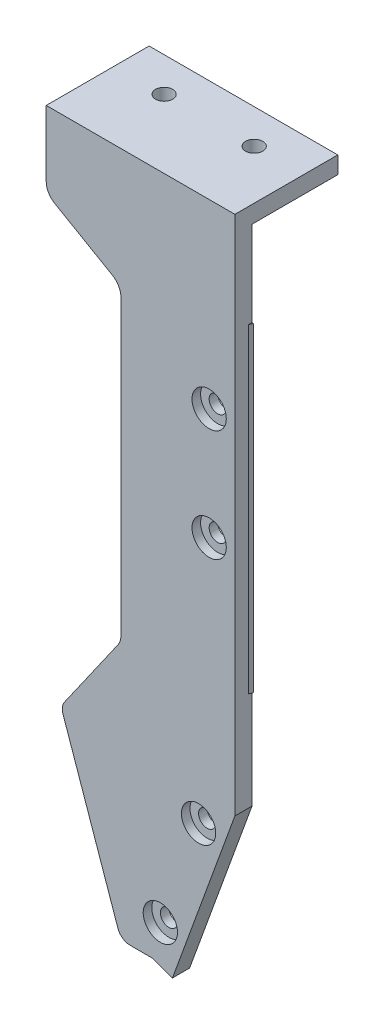
ISO-10303-21;
HEADER;
FILE_DESCRIPTION(('STEP AP214'),'2;1');
FILE_NAME('part.step','',(''),(''),'','','');
FILE_SCHEMA(('AUTOMOTIVE_DESIGN { 1 0 10303 214 1 1 1 1 }'));
ENDSEC;
DATA;
#1=APPLICATION_CONTEXT('core data for automotive mechanical design processes');
#2=APPLICATION_PROTOCOL_DEFINITION('international standard','automotive_design',2000,#1);
#3=PRODUCT_CONTEXT('',#1,'mechanical');
#4=PRODUCT('Part','Part','',(#3));
#5=PRODUCT_RELATED_PRODUCT_CATEGORY('part','',(#4));
#6=PRODUCT_DEFINITION_FORMATION('','',#4);
#7=PRODUCT_DEFINITION_CONTEXT('part definition',#1,'design');
#8=PRODUCT_DEFINITION('design','',#6,#7);
#9=PRODUCT_DEFINITION_SHAPE('','',#8);
#10=(LENGTH_UNIT() NAMED_UNIT(*) SI_UNIT(.MILLI.,.METRE.));
#11=(NAMED_UNIT(*) PLANE_ANGLE_UNIT() SI_UNIT($,.RADIAN.));
#12=(NAMED_UNIT(*) SI_UNIT($,.STERADIAN.) SOLID_ANGLE_UNIT());
#13=UNCERTAINTY_MEASURE_WITH_UNIT(LENGTH_MEASURE(1.E-05),#10,'distance_accuracy_value','');
#14=(GEOMETRIC_REPRESENTATION_CONTEXT(3) GLOBAL_UNCERTAINTY_ASSIGNED_CONTEXT((#13)) GLOBAL_UNIT_ASSIGNED_CONTEXT((#10,
#11,#12)) REPRESENTATION_CONTEXT('',''));
#15=CARTESIAN_POINT('',(0.,0.,0.));
#16=DIRECTION('',(0.,0.,1.));
#17=DIRECTION('',(1.,0.,0.));
#18=AXIS2_PLACEMENT_3D('',#15,#16,#17);
#19=CARTESIAN_POINT('',(91.0567161561715,-93.9915403547906,27.5));
#20=DIRECTION('',(0.,0.,-1.));
#21=DIRECTION('',(-1.,0.,0.));
#22=AXIS2_PLACEMENT_3D('',#19,#20,#21);
#23=CYLINDRICAL_SURFACE('',#22,0.999999999999998);
#24=CARTESIAN_POINT('',(91.0567161561715,-93.9915403547906,21.5));
#25=DIRECTION('',(0.,0.,-1.));
#26=DIRECTION('',(-1.,0.,0.));
#27=AXIS2_PLACEMENT_3D('',#24,#25,#26);
#28=CIRCLE('',#27,0.999999999999998);
#29=CARTESIAN_POINT('',(90.0567161561715,-93.9915403547906,21.5));
#30=VERTEX_POINT('',#29);
#31=EDGE_CURVE('E340',#30,#30,#28,.T.);
#32=ORIENTED_EDGE('',*,*,#31,.T.);
#33=EDGE_LOOP('',(#32));
#34=FACE_BOUND('',#33,.T.);
#35=CARTESIAN_POINT('',(91.0567161561715,-93.9915403547906,22.5));
#36=DIRECTION('',(0.,0.,1.));
#37=DIRECTION('',(1.,0.,0.));
#38=AXIS2_PLACEMENT_3D('',#35,#36,#37);
#39=CIRCLE('',#38,0.999999999999998);
#40=CARTESIAN_POINT('',(92.0567161561715,-93.9915403547906,22.5));
#41=VERTEX_POINT('',#40);
#42=EDGE_CURVE('E40',#41,#41,#39,.F.);
#43=ORIENTED_EDGE('',*,*,#42,.F.);
#44=EDGE_LOOP('',(#43));
#45=FACE_BOUND('',#44,.T.);
#46=ADVANCED_FACE('F36',(#34,#45),#23,.F.);
#47=CARTESIAN_POINT('',(86.6001936886376,-106.235735203631,27.5));
#48=DIRECTION('',(0.,0.,-1.));
#49=DIRECTION('',(-1.,0.,0.));
#50=AXIS2_PLACEMENT_3D('',#47,#48,#49);
#51=CYLINDRICAL_SURFACE('',#50,0.999999999999998);
#52=CARTESIAN_POINT('',(86.6001936886376,-106.235735203631,21.5));
#53=DIRECTION('',(0.,0.,-1.));
#54=DIRECTION('',(-1.,0.,0.));
#55=AXIS2_PLACEMENT_3D('',#52,#53,#54);
#56=CIRCLE('',#55,0.999999999999998);
#57=CARTESIAN_POINT('',(85.6001936886376,-106.235735203631,21.5));
#58=VERTEX_POINT('',#57);
#59=EDGE_CURVE('E365',#58,#58,#56,.T.);
#60=ORIENTED_EDGE('',*,*,#59,.T.);
#61=EDGE_LOOP('',(#60));
#62=FACE_BOUND('',#61,.T.);
#63=CARTESIAN_POINT('',(86.6001936886376,-106.235735203631,22.5));
#64=DIRECTION('',(0.,0.,1.));
#65=DIRECTION('',(1.,0.,0.));
#66=AXIS2_PLACEMENT_3D('',#63,#64,#65);
#67=CIRCLE('',#66,0.999999999999998);
#68=CARTESIAN_POINT('',(87.6001936886376,-106.235735203631,22.5));
#69=VERTEX_POINT('',#68);
#70=EDGE_CURVE('E344',#69,#69,#67,.F.);
#71=ORIENTED_EDGE('',*,*,#70,.F.);
#72=EDGE_LOOP('',(#71));
#73=FACE_BOUND('',#72,.T.);
#74=ADVANCED_FACE('F427',(#62,#73),#51,.F.);
#75=CARTESIAN_POINT('',(92.2895532458189,-64.5135083268963,27.5));
#76=DIRECTION('',(0.,0.,-1.));
#77=DIRECTION('',(-1.,0.,0.));
#78=AXIS2_PLACEMENT_3D('',#75,#76,#77);
#79=CYLINDRICAL_SURFACE('',#78,0.999999999999998);
#80=CARTESIAN_POINT('',(92.2895532458189,-64.5135083268963,21.5));
#81=DIRECTION('',(0.,0.,-1.));
#82=DIRECTION('',(-1.,0.,0.));
#83=AXIS2_PLACEMENT_3D('',#80,#81,#82);
#84=CIRCLE('',#83,0.999999999999998);
#85=CARTESIAN_POINT('',(91.2895532458189,-64.5135083268963,21.5));
#86=VERTEX_POINT('',#85);
#87=EDGE_CURVE('E361',#86,#86,#84,.T.);
#88=ORIENTED_EDGE('',*,*,#87,.T.);
#89=EDGE_LOOP('',(#88));
#90=FACE_BOUND('',#89,.T.);
#91=CARTESIAN_POINT('',(92.2895532458189,-64.5135083268963,22.5));
#92=DIRECTION('',(0.,0.,1.));
#93=DIRECTION('',(1.,0.,0.));
#94=AXIS2_PLACEMENT_3D('',#91,#92,#93);
#95=CIRCLE('',#94,0.999999999999998);
#96=CARTESIAN_POINT('',(93.2895532458189,-64.5135083268963,22.5));
#97=VERTEX_POINT('',#96);
#98=EDGE_CURVE('E342',#97,#97,#95,.F.);
#99=ORIENTED_EDGE('',*,*,#98,.F.);
#100=EDGE_LOOP('',(#99));
#101=FACE_BOUND('',#100,.T.);
#102=ADVANCED_FACE('F434',(#90,#101),#79,.F.);
#103=CARTESIAN_POINT('',(92.2895532458189,-51.5135083268963,27.5));
#104=DIRECTION('',(0.,0.,-1.));
#105=DIRECTION('',(-1.,0.,0.));
#106=AXIS2_PLACEMENT_3D('',#103,#104,#105);
#107=CYLINDRICAL_SURFACE('',#106,0.999999999999998);
#108=CARTESIAN_POINT('',(92.2895532458189,-51.5135083268963,21.5));
#109=DIRECTION('',(0.,0.,-1.));
#110=DIRECTION('',(-1.,0.,0.));
#111=AXIS2_PLACEMENT_3D('',#108,#109,#110);
#112=CIRCLE('',#111,0.999999999999998);
#113=CARTESIAN_POINT('',(91.2895532458189,-51.5135083268963,21.5));
#114=VERTEX_POINT('',#113);
#115=EDGE_CURVE('E364',#114,#114,#112,.T.);
#116=ORIENTED_EDGE('',*,*,#115,.T.);
#117=EDGE_LOOP('',(#116));
#118=FACE_BOUND('',#117,.T.);
#119=CARTESIAN_POINT('',(92.2895532458189,-51.5135083268963,22.5));
#120=DIRECTION('',(0.,0.,1.));
#121=DIRECTION('',(1.,0.,0.));
#122=AXIS2_PLACEMENT_3D('',#119,#120,#121);
#123=CIRCLE('',#122,0.999999999999998);
#124=CARTESIAN_POINT('',(93.2895532458189,-51.5135083268963,22.5));
#125=VERTEX_POINT('',#124);
#126=EDGE_CURVE('E337',#125,#125,#123,.F.);
#127=ORIENTED_EDGE('',*,*,#126,.F.);
#128=EDGE_LOOP('',(#127));
#129=FACE_BOUND('',#128,.T.);
#130=ADVANCED_FACE('F440',(#118,#129),#107,.F.);
#131=CARTESIAN_POINT('',(70.,-110.3,21.5));
#132=DIRECTION('',(0.,0.,1.));
#133=DIRECTION('',(0.,-1.,0.));
#134=AXIS2_PLACEMENT_3D('',#131,#132,#133);
#135=PLANE('',#134);
#136=ORIENTED_EDGE('',*,*,#87,.F.);
#137=EDGE_LOOP('',(#136));
#138=FACE_BOUND('',#137,.T.);
#139=ORIENTED_EDGE('',*,*,#59,.F.);
#140=EDGE_LOOP('',(#139));
#141=FACE_BOUND('',#140,.T.);
#142=ORIENTED_EDGE('',*,*,#31,.F.);
#143=EDGE_LOOP('',(#142));
#144=FACE_BOUND('',#143,.T.);
#145=ORIENTED_EDGE('',*,*,#115,.F.);
#146=EDGE_LOOP('',(#145));
#147=FACE_BOUND('',#146,.T.);
#148=DIRECTION('',(-1.,0.,0.));
#149=VECTOR('',#148,1.);
#150=CARTESIAN_POINT('',(73.2895532458189,-32.3635083268963,21.5));
#151=LINE('',#150,#149);
#152=CARTESIAN_POINT('',(95.2895532458189,-32.3635083268963,21.5));
#153=VERTEX_POINT('',#152);
#154=CARTESIAN_POINT('',(73.2895532458189,-32.3635083268963,21.5));
#155=VERTEX_POINT('',#154);
#156=EDGE_CURVE('E53',#153,#155,#151,.T.);
#157=ORIENTED_EDGE('',*,*,#156,.F.);
#158=DIRECTION('',(0.,1.,0.));
#159=VECTOR('',#158,1.);
#160=CARTESIAN_POINT('',(95.2895532458189,0.,21.5));
#161=LINE('',#160,#159);
#162=CARTESIAN_POINT('',(95.2895532458189,-42.3,21.5));
#163=VERTEX_POINT('',#162);
#164=EDGE_CURVE('E196',#163,#153,#161,.T.);
#165=ORIENTED_EDGE('',*,*,#164,.F.);
#166=DIRECTION('',(1.,0.,0.));
#167=VECTOR('',#166,1.);
#168=CARTESIAN_POINT('',(94.75,-42.3,21.5));
#169=LINE('',#168,#167);
#170=CARTESIAN_POINT('',(95.4364916731037,-42.3,21.5));
#171=VERTEX_POINT('',#170);
#172=EDGE_CURVE('E263',#163,#171,#169,.T.);
#173=ORIENTED_EDGE('',*,*,#172,.T.);
#174=DIRECTION('',(0.,-1.,0.));
#175=VECTOR('',#174,1.);
#176=CARTESIAN_POINT('',(95.4364916731037,-42.3,21.5));
#177=LINE('',#176,#175);
#178=CARTESIAN_POINT('',(95.4364916731037,-79.5997924618132,21.5));
#179=VERTEX_POINT('',#178);
#180=EDGE_CURVE('E265',#171,#179,#177,.T.);
#181=ORIENTED_EDGE('',*,*,#180,.T.);
#182=DIRECTION('',(1.,0.,0.));
#183=VECTOR('',#182,1.);
#184=CARTESIAN_POINT('',(94.38388347648,-79.59979246179,21.5));
#185=LINE('',#184,#183);
#186=CARTESIAN_POINT('',(95.2895532458189,-79.5997924618016,21.5));
#187=VERTEX_POINT('',#186);
#188=EDGE_CURVE('E268',#187,#179,#185,.T.);
#189=ORIENTED_EDGE('',*,*,#188,.F.);
#190=CARTESIAN_POINT('',(95.2895532458189,-91.1333292312439,21.5));
#191=VERTEX_POINT('',#190);
#192=EDGE_CURVE('E209',#191,#187,#161,.T.);
#193=ORIENTED_EDGE('',*,*,#192,.F.);
#194=DIRECTION('',(-0.342020143325699,-0.939692620785897,0.));
#195=VECTOR('',#194,1.);
#196=CARTESIAN_POINT('',(95.2895532458189,-91.1333292312439,21.5));
#197=LINE('',#196,#195);
#198=CARTESIAN_POINT('',(88.0101485604946,-111.133329231243,21.5));
#199=VERTEX_POINT('',#198);
#200=EDGE_CURVE('E260',#191,#199,#197,.T.);
#201=ORIENTED_EDGE('',*,*,#200,.T.);
#202=DIRECTION('',(-0.939692620785897,0.342020143325699,0.));
#203=VECTOR('',#202,1.);
#204=CARTESIAN_POINT('',(86.190441625069,-110.47101007166,21.5));
#205=LINE('',#204,#203);
#206=CARTESIAN_POINT('',(85.720595314676,-110.3,21.5));
#207=VERTEX_POINT('',#206);
#208=EDGE_CURVE('E271',#199,#207,#205,.T.);
#209=ORIENTED_EDGE('',*,*,#208,.T.);
#210=DIRECTION('',(1.,0.,0.));
#211=VECTOR('',#210,1.);
#212=CARTESIAN_POINT('',(83.066681965713,-110.3,21.5));
#213=LINE('',#212,#211);
#214=CARTESIAN_POINT('',(83.066681965713,-110.3,21.5));
#215=VERTEX_POINT('',#214);
#216=EDGE_CURVE('E276',#215,#207,#213,.T.);
#217=ORIENTED_EDGE('',*,*,#216,.F.);
#218=CARTESIAN_POINT('',(83.066681965713,-108.8,21.5));
#219=DIRECTION('',(0.,0.,-1.));
#220=DIRECTION('',(0.,-1.,0.));
#221=AXIS2_PLACEMENT_3D('',#218,#219,#220);
#222=CIRCLE('',#221,1.5);
#223=CARTESIAN_POINT('',(81.6498173079181,-109.29243734778,21.5));
#224=VERTEX_POINT('',#223);
#225=EDGE_CURVE('E275',#215,#224,#222,.T.);
#226=ORIENTED_EDGE('',*,*,#225,.T.);
#227=DIRECTION('',(-0.328291565188003,0.944576438530208,0.));
#228=VECTOR('',#227,1.);
#229=CARTESIAN_POINT('',(81.6498173079181,-109.29243734778,21.5));
#230=LINE('',#229,#228);
#231=CARTESIAN_POINT('',(75.251803773117,-90.88376201398,21.5));
#232=VERTEX_POINT('',#231);
#233=EDGE_CURVE('E281',#224,#232,#230,.T.);
#234=ORIENTED_EDGE('',*,*,#233,.T.);
#235=CARTESIAN_POINT('',(76.668668430912,-90.3913246662,21.5));
#236=DIRECTION('',(0.,0.,-1.));
#237=DIRECTION('',(-0.944576438530206,-0.328291565188007,0.));
#238=AXIS2_PLACEMENT_3D('',#235,#236,#237);
#239=CIRCLE('',#238,1.5);
#240=CARTESIAN_POINT('',(75.439940364479,-89.5309600116699,21.5));
#241=VERTEX_POINT('',#240);
#242=EDGE_CURVE('E284',#232,#241,#239,.T.);
#243=ORIENTED_EDGE('',*,*,#242,.T.);
#244=DIRECTION('',(0.573576436351011,0.819152044289016,0.));
#245=VECTOR('',#244,1.);
#246=CARTESIAN_POINT('',(75.439940364479,-89.5309600116699,21.5));
#247=LINE('',#246,#245);
#248=CARTESIAN_POINT('',(81.638304088578,-80.67877921404,21.5));
#249=VERTEX_POINT('',#248);
#250=EDGE_CURVE('E287',#241,#249,#247,.T.);
#251=ORIENTED_EDGE('',*,*,#250,.T.);
#252=CARTESIAN_POINT('',(80.,-79.5316263413399,21.5));
#253=DIRECTION('',(0.,0.,1.));
#254=DIRECTION('',(0.81915204428897,-0.573576436351077,0.));
#255=AXIS2_PLACEMENT_3D('',#252,#253,#254);
#256=CIRCLE('',#255,2.);
#257=CARTESIAN_POINT('',(82.,-79.5316263413399,21.5));
#258=VERTEX_POINT('',#257);
#259=EDGE_CURVE('E290',#249,#258,#256,.T.);
#260=ORIENTED_EDGE('',*,*,#259,.T.);
#261=DIRECTION('',(0.,1.,0.));
#262=VECTOR('',#261,1.);
#263=CARTESIAN_POINT('',(82.,-79.5316263413399,21.5));
#264=LINE('',#263,#262);
#265=CARTESIAN_POINT('',(82.,-45.38290376865,21.5));
#266=VERTEX_POINT('',#265);
#267=EDGE_CURVE('E293',#258,#266,#264,.T.);
#268=ORIENTED_EDGE('',*,*,#267,.T.);
#269=CARTESIAN_POINT('',(80.,-45.38290376865,21.5));
#270=DIRECTION('',(0.,0.,1.));
#271=DIRECTION('',(1.,0.,0.));
#272=AXIS2_PLACEMENT_3D('',#269,#270,#271);
#273=CIRCLE('',#272,2.);
#274=CARTESIAN_POINT('',(81.,-43.65085296109,21.5));
#275=VERTEX_POINT('',#274);
#276=EDGE_CURVE('E296',#266,#275,#273,.T.);
#277=ORIENTED_EDGE('',*,*,#276,.T.);
#278=DIRECTION('',(-0.866025403784429,0.500000000000017,0.));
#279=VECTOR('',#278,1.);
#280=CARTESIAN_POINT('',(81.,-43.65085296109,21.5));
#281=LINE('',#280,#279);
#282=CARTESIAN_POINT('',(74.2895532458181,-39.7765747211803,21.5));
#283=VERTEX_POINT('',#282);
#284=EDGE_CURVE('E299',#275,#283,#281,.T.);
#285=ORIENTED_EDGE('',*,*,#284,.T.);
#286=CARTESIAN_POINT('',(75.2895532458189,-38.0445239136101,21.5));
#287=DIRECTION('',(0.,0.,1.));
#288=DIRECTION('',(1.,0.,0.));
#289=AXIS2_PLACEMENT_3D('',#286,#287,#288);
#290=CIRCLE('',#289,2.);
#291=CARTESIAN_POINT('',(73.2895532458189,-38.0445239136101,21.5));
#292=VERTEX_POINT('',#291);
#293=EDGE_CURVE('E333',#283,#292,#290,.F.);
#294=ORIENTED_EDGE('',*,*,#293,.T.);
#295=DIRECTION('',(0.,-1.,0.));
#296=VECTOR('',#295,1.);
#297=CARTESIAN_POINT('',(73.2895532458189,0.,21.5));
#298=LINE('',#297,#296);
#299=EDGE_CURVE('E197',#155,#292,#298,.T.);
#300=ORIENTED_EDGE('',*,*,#299,.F.);
#301=EDGE_LOOP('',(#157,#165,#173,#181,#189,#193,#201,#209,#217,#226,#234,#243,#251,#260,#268,
#277,#285,#294,#300));
#302=FACE_BOUND('',#301,.T.);
#303=ADVANCED_FACE('F401',(#138,#141,#144,#147,#302),#135,.F.);
#304=CARTESIAN_POINT('',(93.5,-42.3,21.));
#305=DIRECTION('',(0.,-1.,0.));
#306=DIRECTION('',(-1.,0.,0.));
#307=AXIS2_PLACEMENT_3D('',#304,#305,#306);
#308=CYLINDRICAL_SURFACE('',#307,2.);
#309=CARTESIAN_POINT('',(93.5,-42.3,21.));
#310=DIRECTION('',(0.,-1.,0.));
#311=DIRECTION('',(1.,0.,0.));
#312=AXIS2_PLACEMENT_3D('',#309,#310,#311);
#313=CIRCLE('',#312,2.);
#314=CARTESIAN_POINT('',(95.2895532458189,-42.3,21.8930280960748));
#315=VERTEX_POINT('',#314);
#316=EDGE_CURVE('E323',#171,#315,#313,.T.);
#317=ORIENTED_EDGE('',*,*,#316,.T.);
#318=DIRECTION('',(0.,-1.,0.));
#319=VECTOR('',#318,1.);
#320=CARTESIAN_POINT('',(95.2895532458189,-42.3,21.8930280960748));
#321=LINE('',#320,#319);
#322=CARTESIAN_POINT('',(95.2895532458189,-79.5997924618132,21.8930280960748));
#323=VERTEX_POINT('',#322);
#324=EDGE_CURVE('E255',#315,#323,#321,.T.);
#325=ORIENTED_EDGE('',*,*,#324,.T.);
#326=CARTESIAN_POINT('',(93.5,-79.59979246179,21.));
#327=DIRECTION('',(0.,-1.,0.));
#328=DIRECTION('',(1.,0.,0.));
#329=AXIS2_PLACEMENT_3D('',#326,#327,#328);
#330=CIRCLE('',#329,2.);
#331=EDGE_CURVE('E274',#179,#323,#330,.T.);
#332=ORIENTED_EDGE('',*,*,#331,.F.);
#333=ORIENTED_EDGE('',*,*,#180,.F.);
#334=EDGE_LOOP('',(#317,#325,#332,#333));
#335=FACE_BOUND('',#334,.T.);
#336=ADVANCED_FACE('F408',(#335),#308,.T.);
#337=CARTESIAN_POINT('',(94.38388347648,-79.59979246179,21.88388347648));
#338=DIRECTION('',(0.,1.,0.));
#339=DIRECTION('',(0.,0.,-1.));
#340=AXIS2_PLACEMENT_3D('',#337,#338,#339);
#341=PLANE('',#340);
#342=DIRECTION('',(0.,0.,1.));
#343=VECTOR('',#342,1.);
#344=CARTESIAN_POINT('',(95.2895532458189,-79.59979246179,21.88388347648));
#345=LINE('',#344,#343);
#346=EDGE_CURVE('E258',#187,#323,#345,.T.);
#347=ORIENTED_EDGE('',*,*,#346,.F.);
#348=ORIENTED_EDGE('',*,*,#188,.T.);
#349=ORIENTED_EDGE('',*,*,#331,.T.);
#350=EDGE_LOOP('',(#347,#348,#349));
#351=FACE_BOUND('',#350,.T.);
#352=ADVANCED_FACE('F404',(#351),#341,.F.);
#353=CARTESIAN_POINT('',(94.75,-42.3,18.));
#354=DIRECTION('',(0.,1.,0.));
#355=DIRECTION('',(0.,0.,-1.));
#356=AXIS2_PLACEMENT_3D('',#353,#354,#355);
#357=PLANE('',#356);
#358=ORIENTED_EDGE('',*,*,#172,.F.);
#359=DIRECTION('',(0.,0.,1.));
#360=VECTOR('',#359,1.);
#361=CARTESIAN_POINT('',(95.2895532458189,-42.3,18.));
#362=LINE('',#361,#360);
#363=EDGE_CURVE('E248',#163,#315,#362,.T.);
#364=ORIENTED_EDGE('',*,*,#363,.T.);
#365=ORIENTED_EDGE('',*,*,#316,.F.);
#366=EDGE_LOOP('',(#358,#364,#365));
#367=FACE_BOUND('',#366,.T.);
#368=ADVANCED_FACE('F412',(#367),#357,.T.);
#369=CARTESIAN_POINT('',(76.,-40.76410161514,22.25));
#370=DIRECTION('',(0.500000000000017,0.866025403784429,0.));
#371=DIRECTION('',(0.866025403784429,-0.500000000000017,0.));
#372=AXIS2_PLACEMENT_3D('',#369,#370,#371);
#373=PLANE('',#372);
#374=DIRECTION('',(-0.866025403784429,0.500000000000017,0.));
#375=VECTOR('',#374,1.);
#376=CARTESIAN_POINT('',(1.34862621941938,2.3358891324538,23.5));
#377=LINE('',#376,#375);
#378=CARTESIAN_POINT('',(81.,-43.65085296109,23.5));
#379=VERTEX_POINT('',#378);
#380=CARTESIAN_POINT('',(74.2895532458182,-39.7765747211803,23.5));
#381=VERTEX_POINT('',#380);
#382=EDGE_CURVE('E239',#379,#381,#377,.T.);
#383=ORIENTED_EDGE('',*,*,#382,.T.);
#384=DIRECTION('',(0.,0.,-1.));
#385=VECTOR('',#384,1.);
#386=CARTESIAN_POINT('',(74.2895532458189,-39.776574721179,22.25));
#387=LINE('',#386,#385);
#388=EDGE_CURVE('E330',#381,#283,#387,.T.);
#389=ORIENTED_EDGE('',*,*,#388,.T.);
#390=ORIENTED_EDGE('',*,*,#284,.F.);
#391=DIRECTION('',(0.,0.,-1.));
#392=VECTOR('',#391,1.);
#393=CARTESIAN_POINT('',(81.,-43.65085296109,23.));
#394=LINE('',#393,#392);
#395=EDGE_CURVE('E302',#379,#275,#394,.T.);
#396=ORIENTED_EDGE('',*,*,#395,.F.);
#397=EDGE_LOOP('',(#383,#389,#390,#396));
#398=FACE_BOUND('',#397,.T.);
#399=ADVANCED_FACE('F414',(#398),#373,.F.);
#400=CARTESIAN_POINT('',(80.,-45.38290376865,69.9296));
#401=DIRECTION('',(0.,0.,-1.));
#402=DIRECTION('',(-0.500000000000015,-0.86602540378443,0.));
#403=AXIS2_PLACEMENT_3D('',#400,#401,#402);
#404=CYLINDRICAL_SURFACE('',#403,2.);
#405=ORIENTED_EDGE('',*,*,#276,.F.);
#406=DIRECTION('',(0.,0.,-1.));
#407=VECTOR('',#406,1.);
#408=CARTESIAN_POINT('',(82.,-45.38290376865,23.));
#409=LINE('',#408,#407);
#410=CARTESIAN_POINT('',(82.,-45.38290376865,23.5));
#411=VERTEX_POINT('',#410);
#412=EDGE_CURVE('E305',#411,#266,#409,.T.);
#413=ORIENTED_EDGE('',*,*,#412,.F.);
#414=CARTESIAN_POINT('',(80.,-45.38290376865,23.5));
#415=DIRECTION('',(0.,0.,-1.));
#416=DIRECTION('',(-1.,0.,0.));
#417=AXIS2_PLACEMENT_3D('',#414,#415,#416);
#418=CIRCLE('',#417,2.);
#419=EDGE_CURVE('E236',#411,#379,#418,.F.);
#420=ORIENTED_EDGE('',*,*,#419,.T.);
#421=ORIENTED_EDGE('',*,*,#395,.T.);
#422=EDGE_LOOP('',(#405,#413,#420,#421));
#423=FACE_BOUND('',#422,.T.);
#424=ADVANCED_FACE('F421',(#423),#404,.F.);
#425=CARTESIAN_POINT('',(82.,-62.19521357469,22.25));
#426=DIRECTION('',(1.,0.,0.));
#427=DIRECTION('',(0.,-1.,0.));
#428=AXIS2_PLACEMENT_3D('',#425,#426,#427);
#429=PLANE('',#428);
#430=DIRECTION('',(0.,0.,-1.));
#431=VECTOR('',#430,1.);
#432=CARTESIAN_POINT('',(82.,-79.5316263413399,23.));
#433=LINE('',#432,#431);
#434=CARTESIAN_POINT('',(82.,-79.5316263413399,23.5));
#435=VERTEX_POINT('',#434);
#436=EDGE_CURVE('E308',#435,#258,#433,.T.);
#437=ORIENTED_EDGE('',*,*,#436,.F.);
#438=DIRECTION('',(0.,1.,0.));
#439=VECTOR('',#438,1.);
#440=CARTESIAN_POINT('',(82.,0.,23.5));
#441=LINE('',#440,#439);
#442=EDGE_CURVE('E233',#435,#411,#441,.T.);
#443=ORIENTED_EDGE('',*,*,#442,.T.);
#444=ORIENTED_EDGE('',*,*,#412,.T.);
#445=ORIENTED_EDGE('',*,*,#267,.F.);
#446=EDGE_LOOP('',(#437,#443,#444,#445));
#447=FACE_BOUND('',#446,.T.);
#448=ADVANCED_FACE('F777',(#447),#429,.F.);
#449=CARTESIAN_POINT('',(80.,-79.5316263413399,69.9296));
#450=DIRECTION('',(0.,0.,-1.));
#451=DIRECTION('',(-1.,0.,0.));
#452=AXIS2_PLACEMENT_3D('',#449,#450,#451);
#453=CYLINDRICAL_SURFACE('',#452,2.);
#454=ORIENTED_EDGE('',*,*,#259,.F.);
#455=DIRECTION('',(0.,0.,-1.));
#456=VECTOR('',#455,1.);
#457=CARTESIAN_POINT('',(81.638304088578,-80.67877921404,23.));
#458=LINE('',#457,#456);
#459=CARTESIAN_POINT('',(81.6383040885789,-80.6787792140407,23.5));
#460=VERTEX_POINT('',#459);
#461=EDGE_CURVE('E312',#460,#249,#458,.T.);
#462=ORIENTED_EDGE('',*,*,#461,.F.);
#463=CARTESIAN_POINT('',(80.,-79.5316263413399,23.5));
#464=DIRECTION('',(0.,0.,-1.));
#465=DIRECTION('',(-1.,0.,0.));
#466=AXIS2_PLACEMENT_3D('',#463,#464,#465);
#467=CIRCLE('',#466,2.);
#468=EDGE_CURVE('E230',#460,#435,#467,.F.);
#469=ORIENTED_EDGE('',*,*,#468,.T.);
#470=ORIENTED_EDGE('',*,*,#436,.T.);
#471=EDGE_LOOP('',(#454,#462,#469,#470));
#472=FACE_BOUND('',#471,.T.);
#473=ADVANCED_FACE('F766',(#472),#453,.F.);
#474=CARTESIAN_POINT('',(76.,-88.7311119595499,22.25));
#475=DIRECTION('',(0.819152044289016,-0.573576436351011,0.));
#476=DIRECTION('',(-0.573576436351011,-0.819152044289016,0.));
#477=AXIS2_PLACEMENT_3D('',#474,#475,#476);
#478=PLANE('',#477);
#479=ORIENTED_EDGE('',*,*,#250,.F.);
#480=DIRECTION('',(0.,0.,1.));
#481=VECTOR('',#480,1.);
#482=CARTESIAN_POINT('',(75.439940364479,-89.5309600116699,21.5));
#483=LINE('',#482,#481);
#484=CARTESIAN_POINT('',(75.439940364479,-89.5309600116699,23.5));
#485=VERTEX_POINT('',#484);
#486=EDGE_CURVE('E311',#241,#485,#483,.T.);
#487=ORIENTED_EDGE('',*,*,#486,.T.);
#488=DIRECTION('',(0.573576436351011,0.819152044289016,0.));
#489=VECTOR('',#488,1.);
#490=CARTESIAN_POINT('',(92.6867510176329,-64.8999617547072,23.5));
#491=LINE('',#490,#489);
#492=EDGE_CURVE('E227',#485,#460,#491,.T.);
#493=ORIENTED_EDGE('',*,*,#492,.T.);
#494=ORIENTED_EDGE('',*,*,#461,.T.);
#495=EDGE_LOOP('',(#479,#487,#493,#494));
#496=FACE_BOUND('',#495,.T.);
#497=ADVANCED_FACE('F755',(#496),#478,.F.);
#498=CARTESIAN_POINT('',(76.668668430912,-90.3913246662,-59.9296));
#499=DIRECTION('',(0.,0.,1.));
#500=DIRECTION('',(0.819152044289016,-0.573576436351012,0.));
#501=AXIS2_PLACEMENT_3D('',#498,#499,#500);
#502=CYLINDRICAL_SURFACE('',#501,1.5);
#503=ORIENTED_EDGE('',*,*,#486,.F.);
#504=ORIENTED_EDGE('',*,*,#242,.F.);
#505=DIRECTION('',(0.,0.,1.));
#506=VECTOR('',#505,1.);
#507=CARTESIAN_POINT('',(75.251803773117,-90.88376201398,21.5));
#508=LINE('',#507,#506);
#509=CARTESIAN_POINT('',(75.2518037731161,-90.8837620139803,23.5));
#510=VERTEX_POINT('',#509);
#511=EDGE_CURVE('E315',#232,#510,#508,.T.);
#512=ORIENTED_EDGE('',*,*,#511,.T.);
#513=CARTESIAN_POINT('',(76.668668430912,-90.3913246662,23.5));
#514=DIRECTION('',(0.,0.,-1.));
#515=DIRECTION('',(-1.,0.,0.));
#516=AXIS2_PLACEMENT_3D('',#513,#514,#515);
#517=CIRCLE('',#516,1.5);
#518=EDGE_CURVE('E224',#510,#485,#517,.T.);
#519=ORIENTED_EDGE('',*,*,#518,.T.);
#520=EDGE_LOOP('',(#503,#504,#512,#519));
#521=FACE_BOUND('',#520,.T.);
#522=ADVANCED_FACE('F744',(#521),#502,.T.);
#523=CARTESIAN_POINT('',(78.5,-100.22962998314,22.25));
#524=DIRECTION('',(0.944576438530208,0.328291565188003,0.));
#525=DIRECTION('',(0.328291565188003,-0.944576438530208,0.));
#526=AXIS2_PLACEMENT_3D('',#523,#524,#525);
#527=PLANE('',#526);
#528=ORIENTED_EDGE('',*,*,#233,.F.);
#529=DIRECTION('',(0.,0.,1.));
#530=VECTOR('',#529,1.);
#531=CARTESIAN_POINT('',(81.6498173079181,-109.29243734778,21.5));
#532=LINE('',#531,#530);
#533=CARTESIAN_POINT('',(81.6498173079181,-109.29243734778,23.5));
#534=VERTEX_POINT('',#533);
#535=EDGE_CURVE('E318',#224,#534,#532,.T.);
#536=ORIENTED_EDGE('',*,*,#535,.T.);
#537=DIRECTION('',(-0.328291565188003,0.944576438530208,0.));
#538=VECTOR('',#537,1.);
#539=CARTESIAN_POINT('',(38.9587796924058,13.5402898498463,23.5));
#540=LINE('',#539,#538);
#541=EDGE_CURVE('E221',#534,#510,#540,.T.);
#542=ORIENTED_EDGE('',*,*,#541,.T.);
#543=ORIENTED_EDGE('',*,*,#511,.F.);
#544=EDGE_LOOP('',(#528,#536,#542,#543));
#545=FACE_BOUND('',#544,.T.);
#546=ADVANCED_FACE('F733',(#545),#527,.F.);
#547=CARTESIAN_POINT('',(83.066681965713,-108.8,-59.9296));
#548=DIRECTION('',(0.,0.,1.));
#549=DIRECTION('',(0.944576438530206,0.328291565188007,0.));
#550=AXIS2_PLACEMENT_3D('',#547,#548,#549);
#551=CYLINDRICAL_SURFACE('',#550,1.5);
#552=ORIENTED_EDGE('',*,*,#535,.F.);
#553=ORIENTED_EDGE('',*,*,#225,.F.);
#554=DIRECTION('',(0.,0.,1.));
#555=VECTOR('',#554,1.);
#556=CARTESIAN_POINT('',(83.066681965713,-110.3,21.5));
#557=LINE('',#556,#555);
#558=CARTESIAN_POINT('',(83.066681965713,-110.3,23.5));
#559=VERTEX_POINT('',#558);
#560=EDGE_CURVE('E278',#215,#559,#557,.T.);
#561=ORIENTED_EDGE('',*,*,#560,.T.);
#562=CARTESIAN_POINT('',(83.066681965713,-108.8,23.5));
#563=DIRECTION('',(0.,0.,-1.));
#564=DIRECTION('',(-1.,0.,0.));
#565=AXIS2_PLACEMENT_3D('',#562,#563,#564);
#566=CIRCLE('',#565,1.5);
#567=EDGE_CURVE('E218',#559,#534,#566,.T.);
#568=ORIENTED_EDGE('',*,*,#567,.T.);
#569=EDGE_LOOP('',(#552,#553,#561,#568));
#570=FACE_BOUND('',#569,.T.);
#571=ADVANCED_FACE('F722',(#570),#551,.T.);
#572=CARTESIAN_POINT('',(81.5,-110.3,22.25));
#573=DIRECTION('',(0.,-1.,0.));
#574=DIRECTION('',(-1.,0.,0.));
#575=AXIS2_PLACEMENT_3D('',#572,#573,#574);
#576=PLANE('',#575);
#577=ORIENTED_EDGE('',*,*,#216,.T.);
#578=DIRECTION('',(0.,0.,-1.));
#579=VECTOR('',#578,1.);
#580=CARTESIAN_POINT('',(85.720595314676,-110.3,23.));
#581=LINE('',#580,#579);
#582=CARTESIAN_POINT('',(85.720595314676,-110.3,23.5));
#583=VERTEX_POINT('',#582);
#584=EDGE_CURVE('E270',#583,#207,#581,.T.);
#585=ORIENTED_EDGE('',*,*,#584,.F.);
#586=DIRECTION('',(-1.,0.,0.));
#587=VECTOR('',#586,1.);
#588=CARTESIAN_POINT('',(-1.77186336060973E-12,-110.299999999999,23.5));
#589=LINE('',#588,#587);
#590=EDGE_CURVE('E215',#583,#559,#589,.T.);
#591=ORIENTED_EDGE('',*,*,#590,.T.);
#592=ORIENTED_EDGE('',*,*,#560,.F.);
#593=EDGE_LOOP('',(#577,#585,#591,#592));
#594=FACE_BOUND('',#593,.T.);
#595=ADVANCED_FACE('F712',(#594),#576,.T.);
#596=CARTESIAN_POINT('',(86.190441625069,-110.47101007166,22.25));
#597=DIRECTION('',(-0.342020143325699,-0.939692620785897,0.));
#598=DIRECTION('',(-0.939692620785897,0.342020143325699,0.));
#599=AXIS2_PLACEMENT_3D('',#596,#597,#598);
#600=PLANE('',#599);
#601=ORIENTED_EDGE('',*,*,#208,.F.);
#602=DIRECTION('',(0.,0.,-1.));
#603=VECTOR('',#602,1.);
#604=CARTESIAN_POINT('',(88.0101485604946,-111.133329231243,23.5));
#605=LINE('',#604,#603);
#606=CARTESIAN_POINT('',(88.0101485604946,-111.133329231243,23.5));
#607=VERTEX_POINT('',#606);
#608=EDGE_CURVE('E249',#607,#199,#605,.T.);
#609=ORIENTED_EDGE('',*,*,#608,.F.);
#610=DIRECTION('',(-0.939692620785897,0.342020143325699,0.));
#611=VECTOR('',#610,1.);
#612=CARTESIAN_POINT('',(-25.4223318677038,-69.8472827563908,23.5));
#613=LINE('',#612,#611);
#614=EDGE_CURVE('E212',#607,#583,#613,.T.);
#615=ORIENTED_EDGE('',*,*,#614,.T.);
#616=ORIENTED_EDGE('',*,*,#584,.T.);
#617=EDGE_LOOP('',(#601,#609,#615,#616));
#618=FACE_BOUND('',#617,.T.);
#619=ADVANCED_FACE('F470',(#618),#600,.T.);
#620=CARTESIAN_POINT('',(95.2895532458189,0.,23.5));
#621=DIRECTION('',(-1.,0.,0.));
#622=DIRECTION('',(0.,0.,1.));
#623=AXIS2_PLACEMENT_3D('',#620,#621,#622);
#624=PLANE('',#623);
#625=ORIENTED_EDGE('',*,*,#192,.T.);
#626=ORIENTED_EDGE('',*,*,#346,.T.);
#627=ORIENTED_EDGE('',*,*,#324,.F.);
#628=ORIENTED_EDGE('',*,*,#363,.F.);
#629=ORIENTED_EDGE('',*,*,#164,.T.);
#630=DIRECTION('',(0.,0.,1.));
#631=VECTOR('',#630,1.);
#632=CARTESIAN_POINT('',(95.2895532458189,-32.3635083268963,11.5));
#633=LINE('',#632,#631);
#634=CARTESIAN_POINT('',(95.2895532458189,-32.3635083268963,11.5));
#635=VERTEX_POINT('',#634);
#636=EDGE_CURVE('E178',#635,#153,#633,.T.);
#637=ORIENTED_EDGE('',*,*,#636,.F.);
#638=DIRECTION('',(0.,-1.,0.));
#639=VECTOR('',#638,1.);
#640=CARTESIAN_POINT('',(95.2895532458189,-32.3635083268963,11.5));
#641=LINE('',#640,#639);
#642=CARTESIAN_POINT('',(95.2895532458189,-30.3635083268963,11.5));
#643=VERTEX_POINT('',#642);
#644=EDGE_CURVE('E185',#643,#635,#641,.T.);
#645=ORIENTED_EDGE('',*,*,#644,.F.);
#646=DIRECTION('',(0.,0.,-1.));
#647=VECTOR('',#646,1.);
#648=CARTESIAN_POINT('',(95.2895532458189,-30.3635083268963,23.5));
#649=LINE('',#648,#647);
#650=CARTESIAN_POINT('',(95.2895532458189,-30.3635083268963,23.5));
#651=VERTEX_POINT('',#650);
#652=EDGE_CURVE('E246',#651,#643,#649,.T.);
#653=ORIENTED_EDGE('',*,*,#652,.F.);
#654=DIRECTION('',(0.,1.,0.));
#655=VECTOR('',#654,1.);
#656=CARTESIAN_POINT('',(95.2895532458189,0.,23.5));
#657=LINE('',#656,#655);
#658=CARTESIAN_POINT('',(95.2895532458189,-91.1333292312439,23.5));
#659=VERTEX_POINT('',#658);
#660=EDGE_CURVE('E205',#659,#651,#657,.T.);
#661=ORIENTED_EDGE('',*,*,#660,.F.);
#662=DIRECTION('',(0.,0.,-1.));
#663=VECTOR('',#662,1.);
#664=CARTESIAN_POINT('',(95.2895532458189,-91.1333292312439,23.5));
#665=LINE('',#664,#663);
#666=EDGE_CURVE('E244',#659,#191,#665,.T.);
#667=ORIENTED_EDGE('',*,*,#666,.T.);
#668=EDGE_LOOP('',(#625,#626,#627,#628,#629,#637,#645,#653,#661,#667));
#669=FACE_BOUND('',#668,.T.);
#670=ADVANCED_FACE('F195',(#669),#624,.F.);
#671=CARTESIAN_POINT('',(0.,-30.3635083268963,23.5));
#672=DIRECTION('',(0.,1.,0.));
#673=DIRECTION('',(0.,0.,1.));
#674=AXIS2_PLACEMENT_3D('',#671,#672,#673);
#675=PLANE('',#674);
#676=CARTESIAN_POINT('',(89.5395532458189,-30.3635083268963,15.5));
#677=DIRECTION('',(0.,1.,0.));
#678=DIRECTION('',(0.,0.,1.));
#679=AXIS2_PLACEMENT_3D('',#676,#677,#678);
#680=CIRCLE('',#679,0.999999999999998);
#681=CARTESIAN_POINT('',(89.5395532458189,-30.3635083268963,16.5));
#682=VERTEX_POINT('',#681);
#683=EDGE_CURVE('E375',#682,#682,#680,.T.);
#684=ORIENTED_EDGE('',*,*,#683,.F.);
#685=EDGE_LOOP('',(#684));
#686=FACE_BOUND('',#685,.T.);
#687=CARTESIAN_POINT('',(79.0395532458189,-30.3635083268963,15.5));
#688=DIRECTION('',(0.,1.,0.));
#689=DIRECTION('',(0.,0.,1.));
#690=AXIS2_PLACEMENT_3D('',#687,#688,#689);
#691=CIRCLE('',#690,0.999999999999998);
#692=CARTESIAN_POINT('',(79.0395532458189,-30.3635083268963,16.5));
#693=VERTEX_POINT('',#692);
#694=EDGE_CURVE('E381',#693,#693,#691,.T.);
#695=ORIENTED_EDGE('',*,*,#694,.F.);
#696=EDGE_LOOP('',(#695));
#697=FACE_BOUND('',#696,.T.);
#698=DIRECTION('',(0.,0.,-1.));
#699=VECTOR('',#698,1.);
#700=CARTESIAN_POINT('',(73.2895532458189,-30.3635083268963,31.5));
#701=LINE('',#700,#699);
#702=CARTESIAN_POINT('',(73.2895532458189,-30.3635083268963,23.5));
#703=VERTEX_POINT('',#702);
#704=CARTESIAN_POINT('',(73.2895532458189,-30.3635083268963,11.5));
#705=VERTEX_POINT('',#704);
#706=EDGE_CURVE('E199',#703,#705,#701,.T.);
#707=ORIENTED_EDGE('',*,*,#706,.F.);
#708=DIRECTION('',(1.,0.,0.));
#709=VECTOR('',#708,1.);
#710=CARTESIAN_POINT('',(0.,-30.3635083268963,23.5));
#711=LINE('',#710,#709);
#712=EDGE_CURVE('E242',#703,#651,#711,.T.);
#713=ORIENTED_EDGE('',*,*,#712,.T.);
#714=ORIENTED_EDGE('',*,*,#652,.T.);
#715=DIRECTION('',(1.,0.,0.));
#716=VECTOR('',#715,1.);
#717=CARTESIAN_POINT('',(95.2895532458189,-30.3635083268963,11.5));
#718=LINE('',#717,#716);
#719=EDGE_CURVE('E191',#705,#643,#718,.T.);
#720=ORIENTED_EDGE('',*,*,#719,.F.);
#721=EDGE_LOOP('',(#707,#713,#714,#720));
#722=FACE_BOUND('',#721,.T.);
#723=ADVANCED_FACE('F388',(#686,#697,#722),#675,.T.);
#724=CARTESIAN_POINT('',(113.432480428198,-41.2860464748519,23.5));
#725=DIRECTION('',(0.939692620785897,-0.342020143325699,0.));
#726=DIRECTION('',(0.342020143325699,0.939692620785897,0.));
#727=AXIS2_PLACEMENT_3D('',#724,#725,#726);
#728=PLANE('',#727);
#729=ORIENTED_EDGE('',*,*,#200,.F.);
#730=ORIENTED_EDGE('',*,*,#666,.F.);
#731=DIRECTION('',(-0.342020143325699,-0.939692620785897,0.));
#732=VECTOR('',#731,1.);
#733=CARTESIAN_POINT('',(113.432480428198,-41.2860464748519,23.5));
#734=LINE('',#733,#732);
#735=EDGE_CURVE('E208',#659,#607,#734,.T.);
#736=ORIENTED_EDGE('',*,*,#735,.T.);
#737=ORIENTED_EDGE('',*,*,#608,.T.);
#738=EDGE_LOOP('',(#729,#730,#736,#737));
#739=FACE_BOUND('',#738,.T.);
#740=ADVANCED_FACE('F397',(#739),#728,.T.);
#741=CARTESIAN_POINT('',(0.,0.,23.5));
#742=DIRECTION('',(0.,0.,-1.));
#743=DIRECTION('',(-1.,0.,0.));
#744=AXIS2_PLACEMENT_3D('',#741,#742,#743);
#745=PLANE('',#744);
#746=CARTESIAN_POINT('',(92.2895532458189,-64.5135083268963,23.5));
#747=DIRECTION('',(0.,0.,1.));
#748=DIRECTION('',(1.,0.,0.));
#749=AXIS2_PLACEMENT_3D('',#746,#747,#748);
#750=CIRCLE('',#749,2.);
#751=CARTESIAN_POINT('',(94.2895532458189,-64.5135083268963,23.5));
#752=VERTEX_POINT('',#751);
#753=EDGE_CURVE('E545',#752,#752,#750,.T.);
#754=ORIENTED_EDGE('',*,*,#753,.F.);
#755=EDGE_LOOP('',(#754));
#756=FACE_BOUND('',#755,.T.);
#757=CARTESIAN_POINT('',(91.0567161561715,-93.9915403547906,23.5));
#758=DIRECTION('',(0.,0.,1.));
#759=DIRECTION('',(1.,0.,0.));
#760=AXIS2_PLACEMENT_3D('',#757,#758,#759);
#761=CIRCLE('',#760,2.);
#762=CARTESIAN_POINT('',(93.0567161561715,-93.9915403547906,23.5));
#763=VERTEX_POINT('',#762);
#764=EDGE_CURVE('E535',#763,#763,#761,.T.);
#765=ORIENTED_EDGE('',*,*,#764,.F.);
#766=EDGE_LOOP('',(#765));
#767=FACE_BOUND('',#766,.T.);
#768=CARTESIAN_POINT('',(86.6001936886376,-106.235735203631,23.5));
#769=DIRECTION('',(0.,0.,1.));
#770=DIRECTION('',(1.,0.,0.));
#771=AXIS2_PLACEMENT_3D('',#768,#769,#770);
#772=CIRCLE('',#771,2.);
#773=CARTESIAN_POINT('',(88.6001936886376,-106.235735203631,23.5));
#774=VERTEX_POINT('',#773);
#775=EDGE_CURVE('E536',#774,#774,#772,.T.);
#776=ORIENTED_EDGE('',*,*,#775,.F.);
#777=EDGE_LOOP('',(#776));
#778=FACE_BOUND('',#777,.T.);
#779=CARTESIAN_POINT('',(92.2895532458189,-51.5135083268963,23.5));
#780=DIRECTION('',(0.,0.,1.));
#781=DIRECTION('',(1.,0.,0.));
#782=AXIS2_PLACEMENT_3D('',#779,#780,#781);
#783=CIRCLE('',#782,2.);
#784=CARTESIAN_POINT('',(94.2895532458189,-51.5135083268963,23.5));
#785=VERTEX_POINT('',#784);
#786=EDGE_CURVE('E350',#785,#785,#783,.T.);
#787=ORIENTED_EDGE('',*,*,#786,.F.);
#788=EDGE_LOOP('',(#787));
#789=FACE_BOUND('',#788,.T.);
#790=DIRECTION('',(0.,-1.,0.));
#791=VECTOR('',#790,1.);
#792=CARTESIAN_POINT('',(73.2895532458189,0.,23.5));
#793=LINE('',#792,#791);
#794=CARTESIAN_POINT('',(73.2895532458189,-38.0445239136101,23.5));
#795=VERTEX_POINT('',#794);
#796=EDGE_CURVE('E326',#703,#795,#793,.T.);
#797=ORIENTED_EDGE('',*,*,#796,.T.);
#798=CARTESIAN_POINT('',(75.2895532458189,-38.0445239136101,23.5));
#799=DIRECTION('',(0.,0.,-1.));
#800=DIRECTION('',(-1.,0.,0.));
#801=AXIS2_PLACEMENT_3D('',#798,#799,#800);
#802=CIRCLE('',#801,2.);
#803=EDGE_CURVE('E11',#795,#381,#802,.F.);
#804=ORIENTED_EDGE('',*,*,#803,.T.);
#805=ORIENTED_EDGE('',*,*,#382,.F.);
#806=ORIENTED_EDGE('',*,*,#419,.F.);
#807=ORIENTED_EDGE('',*,*,#442,.F.);
#808=ORIENTED_EDGE('',*,*,#468,.F.);
#809=ORIENTED_EDGE('',*,*,#492,.F.);
#810=ORIENTED_EDGE('',*,*,#518,.F.);
#811=ORIENTED_EDGE('',*,*,#541,.F.);
#812=ORIENTED_EDGE('',*,*,#567,.F.);
#813=ORIENTED_EDGE('',*,*,#590,.F.);
#814=ORIENTED_EDGE('',*,*,#614,.F.);
#815=ORIENTED_EDGE('',*,*,#735,.F.);
#816=ORIENTED_EDGE('',*,*,#660,.T.);
#817=ORIENTED_EDGE('',*,*,#712,.F.);
#818=EDGE_LOOP('',(#797,#804,#805,#806,#807,#808,#809,#810,#811,#812,#813,#814,#815,#816,#817));
#819=FACE_BOUND('',#818,.T.);
#820=ADVANCED_FACE('F394',(#756,#767,#778,#789,#819),#745,.F.);
#821=CARTESIAN_POINT('',(73.2895532458189,0.,31.5));
#822=DIRECTION('',(1.,0.,0.));
#823=DIRECTION('',(0.,0.,-1.));
#824=AXIS2_PLACEMENT_3D('',#821,#822,#823);
#825=PLANE('',#824);
#826=ORIENTED_EDGE('',*,*,#706,.T.);
#827=DIRECTION('',(0.,1.,0.));
#828=VECTOR('',#827,1.);
#829=CARTESIAN_POINT('',(73.2895532458189,-30.3635083268963,11.5));
#830=LINE('',#829,#828);
#831=CARTESIAN_POINT('',(73.2895532458189,-32.3635083268963,11.5));
#832=VERTEX_POINT('',#831);
#833=EDGE_CURVE('E184',#832,#705,#830,.T.);
#834=ORIENTED_EDGE('',*,*,#833,.F.);
#835=DIRECTION('',(0.,0.,1.));
#836=VECTOR('',#835,1.);
#837=CARTESIAN_POINT('',(73.2895532458189,-32.3635083268963,11.5));
#838=LINE('',#837,#836);
#839=EDGE_CURVE('E180',#832,#155,#838,.T.);
#840=ORIENTED_EDGE('',*,*,#839,.T.);
#841=ORIENTED_EDGE('',*,*,#299,.T.);
#842=DIRECTION('',(0.,0.,-1.));
#843=VECTOR('',#842,1.);
#844=CARTESIAN_POINT('',(73.2895532458189,-38.0445239136101,31.5));
#845=LINE('',#844,#843);
#846=EDGE_CURVE('E45',#292,#795,#845,.F.);
#847=ORIENTED_EDGE('',*,*,#846,.T.);
#848=ORIENTED_EDGE('',*,*,#796,.F.);
#849=EDGE_LOOP('',(#826,#834,#840,#841,#847,#848));
#850=FACE_BOUND('',#849,.T.);
#851=ADVANCED_FACE('F385',(#850),#825,.F.);
#852=CARTESIAN_POINT('',(75.2895532458189,-38.0445239136101,22.25));
#853=DIRECTION('',(0.,0.,-1.));
#854=DIRECTION('',(-1.,0.,0.));
#855=AXIS2_PLACEMENT_3D('',#852,#853,#854);
#856=CYLINDRICAL_SURFACE('',#855,2.);
#857=ORIENTED_EDGE('',*,*,#803,.F.);
#858=ORIENTED_EDGE('',*,*,#846,.F.);
#859=ORIENTED_EDGE('',*,*,#293,.F.);
#860=ORIENTED_EDGE('',*,*,#388,.F.);
#861=EDGE_LOOP('',(#857,#858,#859,#860));
#862=FACE_BOUND('',#861,.T.);
#863=ADVANCED_FACE('F38',(#862),#856,.T.);
#864=CARTESIAN_POINT('',(73.2895532458189,-32.3635083268963,11.5));
#865=DIRECTION('',(0.,1.,0.));
#866=DIRECTION('',(0.,0.,1.));
#867=AXIS2_PLACEMENT_3D('',#864,#865,#866);
#868=PLANE('',#867);
#869=CARTESIAN_POINT('',(89.5395532458189,-32.3635083268963,15.5));
#870=DIRECTION('',(0.,-1.,0.));
#871=DIRECTION('',(0.,0.,-1.));
#872=AXIS2_PLACEMENT_3D('',#869,#870,#871);
#873=CIRCLE('',#872,0.999999999999998);
#874=CARTESIAN_POINT('',(89.5395532458189,-32.3635083268963,14.5));
#875=VERTEX_POINT('',#874);
#876=EDGE_CURVE('E372',#875,#875,#873,.T.);
#877=ORIENTED_EDGE('',*,*,#876,.F.);
#878=EDGE_LOOP('',(#877));
#879=FACE_BOUND('',#878,.T.);
#880=CARTESIAN_POINT('',(79.0395532458189,-32.3635083268963,15.5));
#881=DIRECTION('',(0.,-1.,0.));
#882=DIRECTION('',(0.,0.,-1.));
#883=AXIS2_PLACEMENT_3D('',#880,#881,#882);
#884=CIRCLE('',#883,0.999999999999998);
#885=CARTESIAN_POINT('',(79.0395532458189,-32.3635083268963,14.5));
#886=VERTEX_POINT('',#885);
#887=EDGE_CURVE('E378',#886,#886,#884,.T.);
#888=ORIENTED_EDGE('',*,*,#887,.F.);
#889=EDGE_LOOP('',(#888));
#890=FACE_BOUND('',#889,.T.);
#891=ORIENTED_EDGE('',*,*,#156,.T.);
#892=ORIENTED_EDGE('',*,*,#839,.F.);
#893=DIRECTION('',(-1.,0.,0.));
#894=VECTOR('',#893,1.);
#895=CARTESIAN_POINT('',(73.2895532458189,-32.3635083268963,11.5));
#896=LINE('',#895,#894);
#897=EDGE_CURVE('E174',#635,#832,#896,.T.);
#898=ORIENTED_EDGE('',*,*,#897,.F.);
#899=ORIENTED_EDGE('',*,*,#636,.T.);
#900=EDGE_LOOP('',(#891,#892,#898,#899));
#901=FACE_BOUND('',#900,.T.);
#902=ADVANCED_FACE('F176',(#879,#890,#901),#868,.F.);
#903=CARTESIAN_POINT('',(0.,0.,11.5));
#904=DIRECTION('',(0.,0.,1.));
#905=DIRECTION('',(1.,0.,0.));
#906=AXIS2_PLACEMENT_3D('',#903,#904,#905);
#907=PLANE('',#906);
#908=ORIENTED_EDGE('',*,*,#644,.T.);
#909=ORIENTED_EDGE('',*,*,#897,.T.);
#910=ORIENTED_EDGE('',*,*,#833,.T.);
#911=ORIENTED_EDGE('',*,*,#719,.T.);
#912=EDGE_LOOP('',(#908,#909,#910,#911));
#913=FACE_BOUND('',#912,.T.);
#914=ADVANCED_FACE('F189',(#913),#907,.F.);
#915=CARTESIAN_POINT('',(79.0395532458189,-27.1135083268963,15.5));
#916=DIRECTION('',(0.,-1.,0.));
#917=DIRECTION('',(0.,0.,-1.));
#918=AXIS2_PLACEMENT_3D('',#915,#916,#917);
#919=CYLINDRICAL_SURFACE('',#918,0.999999999999998);
#920=ORIENTED_EDGE('',*,*,#694,.T.);
#921=EDGE_LOOP('',(#920));
#922=FACE_BOUND('',#921,.T.);
#923=ORIENTED_EDGE('',*,*,#887,.T.);
#924=EDGE_LOOP('',(#923));
#925=FACE_BOUND('',#924,.T.);
#926=ADVANCED_FACE('F448',(#922,#925),#919,.F.);
#927=CARTESIAN_POINT('',(89.5395532458189,-27.1135083268963,15.5));
#928=DIRECTION('',(0.,-1.,0.));
#929=DIRECTION('',(0.,0.,-1.));
#930=AXIS2_PLACEMENT_3D('',#927,#928,#929);
#931=CYLINDRICAL_SURFACE('',#930,0.999999999999998);
#932=ORIENTED_EDGE('',*,*,#683,.T.);
#933=EDGE_LOOP('',(#932));
#934=FACE_BOUND('',#933,.T.);
#935=ORIENTED_EDGE('',*,*,#876,.T.);
#936=EDGE_LOOP('',(#935));
#937=FACE_BOUND('',#936,.T.);
#938=ADVANCED_FACE('F444',(#934,#937),#931,.F.);
#939=CARTESIAN_POINT('',(92.2895532458189,-51.5135083268963,22.5));
#940=DIRECTION('',(0.,0.,1.));
#941=DIRECTION('',(1.,0.,0.));
#942=AXIS2_PLACEMENT_3D('',#939,#940,#941);
#943=PLANE('',#942);
#944=CARTESIAN_POINT('',(92.2895532458189,-51.5135083268963,22.5));
#945=DIRECTION('',(0.,0.,1.));
#946=DIRECTION('',(1.,0.,0.));
#947=AXIS2_PLACEMENT_3D('',#944,#945,#946);
#948=CIRCLE('',#947,2.);
#949=CARTESIAN_POINT('',(94.2895532458189,-51.5135083268963,22.5));
#950=VERTEX_POINT('',#949);
#951=EDGE_CURVE('E341',#950,#950,#948,.T.);
#952=ORIENTED_EDGE('',*,*,#951,.T.);
#953=EDGE_LOOP('',(#952));
#954=FACE_BOUND('',#953,.T.);
#955=ORIENTED_EDGE('',*,*,#126,.T.);
#956=EDGE_LOOP('',(#955));
#957=FACE_BOUND('',#956,.T.);
#958=ADVANCED_FACE('F447',(#954,#957),#943,.T.);
#959=CARTESIAN_POINT('',(92.2895532458189,-51.5135083268963,22.5));
#960=DIRECTION('',(0.,0.,1.));
#961=DIRECTION('',(1.,0.,0.));
#962=AXIS2_PLACEMENT_3D('',#959,#960,#961);
#963=CYLINDRICAL_SURFACE('',#962,2.);
#964=ORIENTED_EDGE('',*,*,#951,.F.);
#965=EDGE_LOOP('',(#964));
#966=FACE_BOUND('',#965,.T.);
#967=ORIENTED_EDGE('',*,*,#786,.T.);
#968=EDGE_LOOP('',(#967));
#969=FACE_BOUND('',#968,.T.);
#970=ADVANCED_FACE('F487',(#966,#969),#963,.F.);
#971=CARTESIAN_POINT('',(92.2895532458189,-64.5135083268963,22.5));
#972=DIRECTION('',(0.,0.,1.));
#973=DIRECTION('',(1.,0.,0.));
#974=AXIS2_PLACEMENT_3D('',#971,#972,#973);
#975=PLANE('',#974);
#976=CARTESIAN_POINT('',(92.2895532458189,-64.5135083268963,22.5));
#977=DIRECTION('',(0.,0.,1.));
#978=DIRECTION('',(1.,0.,0.));
#979=AXIS2_PLACEMENT_3D('',#976,#977,#978);
#980=CIRCLE('',#979,2.);
#981=CARTESIAN_POINT('',(94.2895532458189,-64.5135083268963,22.5));
#982=VERTEX_POINT('',#981);
#983=EDGE_CURVE('E345',#982,#982,#980,.T.);
#984=ORIENTED_EDGE('',*,*,#983,.T.);
#985=EDGE_LOOP('',(#984));
#986=FACE_BOUND('',#985,.T.);
#987=ORIENTED_EDGE('',*,*,#98,.T.);
#988=EDGE_LOOP('',(#987));
#989=FACE_BOUND('',#988,.T.);
#990=ADVANCED_FACE('F494',(#986,#989),#975,.T.);
#991=CARTESIAN_POINT('',(92.2895532458189,-64.5135083268963,22.5));
#992=DIRECTION('',(0.,0.,1.));
#993=DIRECTION('',(1.,0.,0.));
#994=AXIS2_PLACEMENT_3D('',#991,#992,#993);
#995=CYLINDRICAL_SURFACE('',#994,2.);
#996=ORIENTED_EDGE('',*,*,#983,.F.);
#997=EDGE_LOOP('',(#996));
#998=FACE_BOUND('',#997,.T.);
#999=ORIENTED_EDGE('',*,*,#753,.T.);
#1000=EDGE_LOOP('',(#999));
#1001=FACE_BOUND('',#1000,.T.);
#1002=ADVANCED_FACE('F508',(#998,#1001),#995,.F.);
#1003=CARTESIAN_POINT('',(86.6001936886376,-106.235735203631,22.5));
#1004=DIRECTION('',(0.,0.,1.));
#1005=DIRECTION('',(1.,0.,0.));
#1006=AXIS2_PLACEMENT_3D('',#1003,#1004,#1005);
#1007=PLANE('',#1006);
#1008=CARTESIAN_POINT('',(86.6001936886376,-106.235735203631,22.5));
#1009=DIRECTION('',(0.,0.,1.));
#1010=DIRECTION('',(1.,0.,0.));
#1011=AXIS2_PLACEMENT_3D('',#1008,#1009,#1010);
#1012=CIRCLE('',#1011,2.);
#1013=CARTESIAN_POINT('',(88.6001936886376,-106.235735203631,22.5));
#1014=VERTEX_POINT('',#1013);
#1015=EDGE_CURVE('E534',#1014,#1014,#1012,.T.);
#1016=ORIENTED_EDGE('',*,*,#1015,.T.);
#1017=EDGE_LOOP('',(#1016));
#1018=FACE_BOUND('',#1017,.T.);
#1019=ORIENTED_EDGE('',*,*,#70,.T.);
#1020=EDGE_LOOP('',(#1019));
#1021=FACE_BOUND('',#1020,.T.);
#1022=ADVANCED_FACE('F514',(#1018,#1021),#1007,.T.);
#1023=CARTESIAN_POINT('',(86.6001936886376,-106.235735203631,22.5));
#1024=DIRECTION('',(0.,0.,1.));
#1025=DIRECTION('',(1.,0.,0.));
#1026=AXIS2_PLACEMENT_3D('',#1023,#1024,#1025);
#1027=CYLINDRICAL_SURFACE('',#1026,2.);
#1028=ORIENTED_EDGE('',*,*,#1015,.F.);
#1029=EDGE_LOOP('',(#1028));
#1030=FACE_BOUND('',#1029,.T.);
#1031=ORIENTED_EDGE('',*,*,#775,.T.);
#1032=EDGE_LOOP('',(#1031));
#1033=FACE_BOUND('',#1032,.T.);
#1034=ADVANCED_FACE('F498',(#1030,#1033),#1027,.F.);
#1035=CARTESIAN_POINT('',(91.0567161561715,-93.9915403547906,22.5));
#1036=DIRECTION('',(0.,0.,1.));
#1037=DIRECTION('',(1.,0.,0.));
#1038=AXIS2_PLACEMENT_3D('',#1035,#1036,#1037);
#1039=PLANE('',#1038);
#1040=CARTESIAN_POINT('',(91.0567161561715,-93.9915403547906,22.5));
#1041=DIRECTION('',(0.,0.,1.));
#1042=DIRECTION('',(1.,0.,0.));
#1043=AXIS2_PLACEMENT_3D('',#1040,#1041,#1042);
#1044=CIRCLE('',#1043,2.);
#1045=CARTESIAN_POINT('',(93.0567161561715,-93.9915403547906,22.5));
#1046=VERTEX_POINT('',#1045);
#1047=EDGE_CURVE('E539',#1046,#1046,#1044,.T.);
#1048=ORIENTED_EDGE('',*,*,#1047,.T.);
#1049=EDGE_LOOP('',(#1048));
#1050=FACE_BOUND('',#1049,.T.);
#1051=ORIENTED_EDGE('',*,*,#42,.T.);
#1052=EDGE_LOOP('',(#1051));
#1053=FACE_BOUND('',#1052,.T.);
#1054=ADVANCED_FACE('F519',(#1050,#1053),#1039,.T.);
#1055=CARTESIAN_POINT('',(91.0567161561715,-93.9915403547906,22.5));
#1056=DIRECTION('',(0.,0.,1.));
#1057=DIRECTION('',(1.,0.,0.));
#1058=AXIS2_PLACEMENT_3D('',#1055,#1056,#1057);
#1059=CYLINDRICAL_SURFACE('',#1058,2.);
#1060=ORIENTED_EDGE('',*,*,#1047,.F.);
#1061=EDGE_LOOP('',(#1060));
#1062=FACE_BOUND('',#1061,.T.);
#1063=ORIENTED_EDGE('',*,*,#764,.T.);
#1064=EDGE_LOOP('',(#1063));
#1065=FACE_BOUND('',#1064,.T.);
#1066=ADVANCED_FACE('F522',(#1062,#1065),#1059,.F.);
#1067=CLOSED_SHELL('',(#46,#74,#102,#130,#303,#336,#352,#368,#399,#424,#448,#473,#497,#522,#546,
#571,#595,#619,#670,#723,#740,#820,#851,#863,#902,#914,#926,#938,#958,#970,#990,#1002,#1022,
#1034,#1054,#1066));
#1068=MANIFOLD_SOLID_BREP('B2',#1067);
#1069=ADVANCED_BREP_SHAPE_REPRESENTATION('',(#18,#1068),#14);
#1070=SHAPE_DEFINITION_REPRESENTATION(#9,#1069);
ENDSEC;
END-ISO-10303-21;
